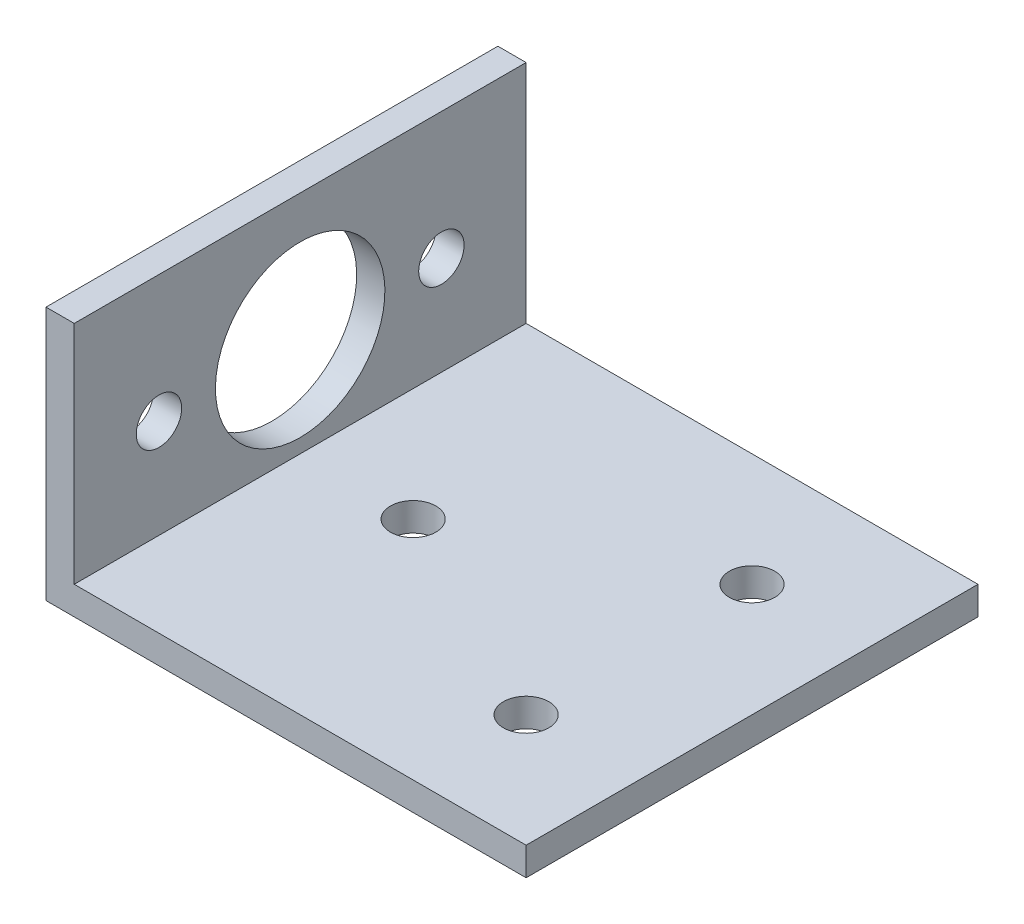
ISO-10303-21;
HEADER;
FILE_DESCRIPTION(('STEP AP214'),'2;1');
FILE_NAME('part.step','',(''),(''),'','','');
FILE_SCHEMA(('AUTOMOTIVE_DESIGN { 1 0 10303 214 1 1 1 1 }'));
ENDSEC;
DATA;
#1=APPLICATION_CONTEXT('core data for automotive mechanical design processes');
#2=APPLICATION_PROTOCOL_DEFINITION('international standard','automotive_design',2000,#1);
#3=PRODUCT_CONTEXT('',#1,'mechanical');
#4=PRODUCT('Part','Part','',(#3));
#5=PRODUCT_RELATED_PRODUCT_CATEGORY('part','',(#4));
#6=PRODUCT_DEFINITION_FORMATION('','',#4);
#7=PRODUCT_DEFINITION_CONTEXT('part definition',#1,'design');
#8=PRODUCT_DEFINITION('design','',#6,#7);
#9=PRODUCT_DEFINITION_SHAPE('','',#8);
#10=(LENGTH_UNIT() NAMED_UNIT(*) SI_UNIT(.MILLI.,.METRE.));
#11=(NAMED_UNIT(*) PLANE_ANGLE_UNIT() SI_UNIT($,.RADIAN.));
#12=(NAMED_UNIT(*) SI_UNIT($,.STERADIAN.) SOLID_ANGLE_UNIT());
#13=UNCERTAINTY_MEASURE_WITH_UNIT(LENGTH_MEASURE(1.E-05),#10,'distance_accuracy_value','');
#14=(GEOMETRIC_REPRESENTATION_CONTEXT(3) GLOBAL_UNCERTAINTY_ASSIGNED_CONTEXT((#13)) GLOBAL_UNIT_ASSIGNED_CONTEXT((#10,
#11,#12)) REPRESENTATION_CONTEXT('',''));
#15=CARTESIAN_POINT('',(0.,0.,0.));
#16=DIRECTION('',(0.,0.,1.));
#17=DIRECTION('',(1.,0.,0.));
#18=AXIS2_PLACEMENT_3D('',#15,#16,#17);
#19=CARTESIAN_POINT('',(3.175,50.8,50.8));
#20=DIRECTION('',(-1.,0.,0.));
#21=DIRECTION('',(0.,-1.,0.));
#22=AXIS2_PLACEMENT_3D('',#19,#20,#21);
#23=PLANE('',#22);
#24=CARTESIAN_POINT('',(3.175,14.2875,41.275));
#25=DIRECTION('',(-1.,0.,0.));
#26=DIRECTION('',(0.,1.,0.));
#27=AXIS2_PLACEMENT_3D('',#24,#25,#26);
#28=CIRCLE('',#27,2.5527);
#29=CARTESIAN_POINT('',(3.175,16.8402,41.275));
#30=VERTEX_POINT('',#29);
#31=EDGE_CURVE('E180',#30,#30,#28,.T.);
#32=ORIENTED_EDGE('',*,*,#31,.T.);
#33=EDGE_LOOP('',(#32));
#34=FACE_BOUND('',#33,.T.);
#35=CARTESIAN_POINT('',(3.175,14.2875,9.525));
#36=DIRECTION('',(-1.,0.,0.));
#37=DIRECTION('',(0.,-1.,0.));
#38=AXIS2_PLACEMENT_3D('',#35,#36,#37);
#39=CIRCLE('',#38,2.5527);
#40=CARTESIAN_POINT('',(3.175,11.7348,9.525));
#41=VERTEX_POINT('',#40);
#42=EDGE_CURVE('E184',#41,#41,#39,.T.);
#43=ORIENTED_EDGE('',*,*,#42,.T.);
#44=EDGE_LOOP('',(#43));
#45=FACE_BOUND('',#44,.T.);
#46=CARTESIAN_POINT('',(3.175,14.2875,25.4));
#47=DIRECTION('',(-1.,0.,0.));
#48=DIRECTION('',(0.,-1.,0.));
#49=AXIS2_PLACEMENT_3D('',#46,#47,#48);
#50=CIRCLE('',#49,9.525);
#51=CARTESIAN_POINT('',(3.17500000000001,4.7625,25.4));
#52=VERTEX_POINT('',#51);
#53=EDGE_CURVE('E115',#52,#52,#50,.T.);
#54=ORIENTED_EDGE('',*,*,#53,.T.);
#55=EDGE_LOOP('',(#54));
#56=FACE_BOUND('',#55,.T.);
#57=DIRECTION('',(0.,1.,0.));
#58=VECTOR('',#57,1.);
#59=CARTESIAN_POINT('',(3.175,50.8,0.));
#60=LINE('',#59,#58);
#61=CARTESIAN_POINT('',(3.17500000000001,3.175,0.));
#62=VERTEX_POINT('',#61);
#63=CARTESIAN_POINT('',(3.175,28.575,0.));
#64=VERTEX_POINT('',#63);
#65=EDGE_CURVE('E111',#62,#64,#60,.T.);
#66=ORIENTED_EDGE('',*,*,#65,.T.);
#67=DIRECTION('',(0.,0.,1.));
#68=VECTOR('',#67,1.);
#69=CARTESIAN_POINT('',(3.175,28.575,50.8));
#70=LINE('',#69,#68);
#71=CARTESIAN_POINT('',(3.175,28.575,50.8));
#72=VERTEX_POINT('',#71);
#73=EDGE_CURVE('E49',#64,#72,#70,.T.);
#74=ORIENTED_EDGE('',*,*,#73,.T.);
#75=DIRECTION('',(0.,1.,0.));
#76=VECTOR('',#75,1.);
#77=CARTESIAN_POINT('',(3.175,50.8,50.8));
#78=LINE('',#77,#76);
#79=CARTESIAN_POINT('',(3.17500000000001,3.175,50.8));
#80=VERTEX_POINT('',#79);
#81=EDGE_CURVE('E121',#80,#72,#78,.T.);
#82=ORIENTED_EDGE('',*,*,#81,.F.);
#83=DIRECTION('',(0.,0.,-1.));
#84=VECTOR('',#83,1.);
#85=CARTESIAN_POINT('',(3.17500000000001,3.175,50.8));
#86=LINE('',#85,#84);
#87=EDGE_CURVE('E122',#80,#62,#86,.T.);
#88=ORIENTED_EDGE('',*,*,#87,.T.);
#89=EDGE_LOOP('',(#66,#74,#82,#88));
#90=FACE_BOUND('',#89,.T.);
#91=ADVANCED_FACE('F33',(#34,#45,#56,#90),#23,.F.);
#92=CARTESIAN_POINT('',(0.,50.8,50.8));
#93=DIRECTION('',(1.,0.,0.));
#94=DIRECTION('',(0.,1.,0.));
#95=AXIS2_PLACEMENT_3D('',#92,#93,#94);
#96=PLANE('',#95);
#97=CARTESIAN_POINT('',(0.,14.2875,41.275));
#98=DIRECTION('',(-1.,0.,0.));
#99=DIRECTION('',(0.,1.,0.));
#100=AXIS2_PLACEMENT_3D('',#97,#98,#99);
#101=CIRCLE('',#100,2.5527);
#102=CARTESIAN_POINT('',(0.,16.8402,41.275));
#103=VERTEX_POINT('',#102);
#104=EDGE_CURVE('E244',#103,#103,#101,.T.);
#105=ORIENTED_EDGE('',*,*,#104,.F.);
#106=EDGE_LOOP('',(#105));
#107=FACE_BOUND('',#106,.T.);
#108=CARTESIAN_POINT('',(0.,14.2875,9.525));
#109=DIRECTION('',(-1.,0.,0.));
#110=DIRECTION('',(0.,-1.,0.));
#111=AXIS2_PLACEMENT_3D('',#108,#109,#110);
#112=CIRCLE('',#111,2.5527);
#113=CARTESIAN_POINT('',(0.,11.7348,9.525));
#114=VERTEX_POINT('',#113);
#115=EDGE_CURVE('E246',#114,#114,#112,.T.);
#116=ORIENTED_EDGE('',*,*,#115,.F.);
#117=EDGE_LOOP('',(#116));
#118=FACE_BOUND('',#117,.T.);
#119=CARTESIAN_POINT('',(0.,14.2875,25.4));
#120=DIRECTION('',(-1.,0.,0.));
#121=DIRECTION('',(0.,-1.,0.));
#122=AXIS2_PLACEMENT_3D('',#119,#120,#121);
#123=CIRCLE('',#122,9.525);
#124=CARTESIAN_POINT('',(0.,4.7625,25.4));
#125=VERTEX_POINT('',#124);
#126=EDGE_CURVE('E150',#125,#125,#123,.T.);
#127=ORIENTED_EDGE('',*,*,#126,.F.);
#128=EDGE_LOOP('',(#127));
#129=FACE_BOUND('',#128,.T.);
#130=DIRECTION('',(0.,-1.,0.));
#131=VECTOR('',#130,1.);
#132=CARTESIAN_POINT('',(0.,50.8,50.8));
#133=LINE('',#132,#131);
#134=CARTESIAN_POINT('',(0.,28.575,50.8));
#135=VERTEX_POINT('',#134);
#136=CARTESIAN_POINT('',(0.,0.,50.8));
#137=VERTEX_POINT('',#136);
#138=EDGE_CURVE('E85',#135,#137,#133,.T.);
#139=ORIENTED_EDGE('',*,*,#138,.F.);
#140=DIRECTION('',(0.,0.,1.));
#141=VECTOR('',#140,1.);
#142=CARTESIAN_POINT('',(0.,28.575,50.8));
#143=LINE('',#142,#141);
#144=CARTESIAN_POINT('',(0.,28.575,0.));
#145=VERTEX_POINT('',#144);
#146=EDGE_CURVE('E95',#145,#135,#143,.T.);
#147=ORIENTED_EDGE('',*,*,#146,.F.);
#148=DIRECTION('',(0.,-1.,0.));
#149=VECTOR('',#148,1.);
#150=CARTESIAN_POINT('',(0.,50.8,0.));
#151=LINE('',#150,#149);
#152=CARTESIAN_POINT('',(0.,0.,0.));
#153=VERTEX_POINT('',#152);
#154=EDGE_CURVE('E102',#145,#153,#151,.T.);
#155=ORIENTED_EDGE('',*,*,#154,.T.);
#156=DIRECTION('',(0.,0.,-1.));
#157=VECTOR('',#156,1.);
#158=CARTESIAN_POINT('',(0.,0.,50.8));
#159=LINE('',#158,#157);
#160=EDGE_CURVE('E41',#137,#153,#159,.T.);
#161=ORIENTED_EDGE('',*,*,#160,.F.);
#162=EDGE_LOOP('',(#139,#147,#155,#161));
#163=FACE_BOUND('',#162,.T.);
#164=ADVANCED_FACE('F101',(#107,#118,#129,#163),#96,.F.);
#165=CARTESIAN_POINT('',(3.17500000000001,0.,50.8));
#166=DIRECTION('',(0.,1.,0.));
#167=DIRECTION('',(-1.,0.,0.));
#168=AXIS2_PLACEMENT_3D('',#165,#166,#167);
#169=PLANE('',#168);
#170=CARTESIAN_POINT('',(41.275,0.,12.7));
#171=DIRECTION('',(0.,-1.,0.));
#172=DIRECTION('',(1.,0.,0.));
#173=AXIS2_PLACEMENT_3D('',#170,#171,#172);
#174=CIRCLE('',#173,2.5527);
#175=CARTESIAN_POINT('',(43.8277,0.,12.7));
#176=VERTEX_POINT('',#175);
#177=EDGE_CURVE('E144',#176,#176,#174,.T.);
#178=ORIENTED_EDGE('',*,*,#177,.F.);
#179=EDGE_LOOP('',(#178));
#180=FACE_BOUND('',#179,.T.);
#181=CARTESIAN_POINT('',(41.275,0.,38.1));
#182=DIRECTION('',(0.,-1.,0.));
#183=DIRECTION('',(1.,0.,0.));
#184=AXIS2_PLACEMENT_3D('',#181,#182,#183);
#185=CIRCLE('',#184,2.5527);
#186=CARTESIAN_POINT('',(43.8277,0.,38.1));
#187=VERTEX_POINT('',#186);
#188=EDGE_CURVE('E134',#187,#187,#185,.T.);
#189=ORIENTED_EDGE('',*,*,#188,.F.);
#190=EDGE_LOOP('',(#189));
#191=FACE_BOUND('',#190,.T.);
#192=CARTESIAN_POINT('',(15.875,0.,25.4));
#193=DIRECTION('',(0.,-1.,0.));
#194=DIRECTION('',(1.,0.,0.));
#195=AXIS2_PLACEMENT_3D('',#192,#193,#194);
#196=CIRCLE('',#195,2.5527);
#197=CARTESIAN_POINT('',(18.4277,0.,25.4));
#198=VERTEX_POINT('',#197);
#199=EDGE_CURVE('E131',#198,#198,#196,.T.);
#200=ORIENTED_EDGE('',*,*,#199,.F.);
#201=EDGE_LOOP('',(#200));
#202=FACE_BOUND('',#201,.T.);
#203=DIRECTION('',(1.,0.,0.));
#204=VECTOR('',#203,1.);
#205=CARTESIAN_POINT('',(3.17500000000001,0.,0.));
#206=LINE('',#205,#204);
#207=CARTESIAN_POINT('',(53.975,0.,0.));
#208=VERTEX_POINT('',#207);
#209=EDGE_CURVE('E109',#153,#208,#206,.T.);
#210=ORIENTED_EDGE('',*,*,#209,.T.);
#211=DIRECTION('',(0.,0.,-1.));
#212=VECTOR('',#211,1.);
#213=CARTESIAN_POINT('',(53.975,0.,50.8));
#214=LINE('',#213,#212);
#215=CARTESIAN_POINT('',(53.975,0.,50.8));
#216=VERTEX_POINT('',#215);
#217=EDGE_CURVE('E126',#216,#208,#214,.T.);
#218=ORIENTED_EDGE('',*,*,#217,.F.);
#219=DIRECTION('',(1.,0.,0.));
#220=VECTOR('',#219,1.);
#221=CARTESIAN_POINT('',(3.17500000000001,0.,50.8));
#222=LINE('',#221,#220);
#223=EDGE_CURVE('E157',#137,#216,#222,.T.);
#224=ORIENTED_EDGE('',*,*,#223,.F.);
#225=ORIENTED_EDGE('',*,*,#160,.T.);
#226=EDGE_LOOP('',(#210,#218,#224,#225));
#227=FACE_BOUND('',#226,.T.);
#228=ADVANCED_FACE('F175',(#180,#191,#202,#227),#169,.F.);
#229=CARTESIAN_POINT('',(53.975,0.,50.8));
#230=DIRECTION('',(-1.,0.,0.));
#231=DIRECTION('',(0.,0.,1.));
#232=AXIS2_PLACEMENT_3D('',#229,#230,#231);
#233=PLANE('',#232);
#234=DIRECTION('',(0.,1.,0.));
#235=VECTOR('',#234,1.);
#236=CARTESIAN_POINT('',(53.975,0.,0.));
#237=LINE('',#236,#235);
#238=CARTESIAN_POINT('',(53.975,3.175,0.));
#239=VERTEX_POINT('',#238);
#240=EDGE_CURVE('E113',#208,#239,#237,.T.);
#241=ORIENTED_EDGE('',*,*,#240,.T.);
#242=DIRECTION('',(0.,0.,-1.));
#243=VECTOR('',#242,1.);
#244=CARTESIAN_POINT('',(53.975,3.175,50.8));
#245=LINE('',#244,#243);
#246=CARTESIAN_POINT('',(53.975,3.175,50.8));
#247=VERTEX_POINT('',#246);
#248=EDGE_CURVE('E124',#247,#239,#245,.T.);
#249=ORIENTED_EDGE('',*,*,#248,.F.);
#250=DIRECTION('',(0.,1.,0.));
#251=VECTOR('',#250,1.);
#252=CARTESIAN_POINT('',(53.975,0.,50.8));
#253=LINE('',#252,#251);
#254=EDGE_CURVE('E159',#216,#247,#253,.T.);
#255=ORIENTED_EDGE('',*,*,#254,.F.);
#256=ORIENTED_EDGE('',*,*,#217,.T.);
#257=EDGE_LOOP('',(#241,#249,#255,#256));
#258=FACE_BOUND('',#257,.T.);
#259=ADVANCED_FACE('F166',(#258),#233,.F.);
#260=CARTESIAN_POINT('',(3.17500000000001,3.175,50.8));
#261=DIRECTION('',(0.,-1.,0.));
#262=DIRECTION('',(0.,0.,-1.));
#263=AXIS2_PLACEMENT_3D('',#260,#261,#262);
#264=PLANE('',#263);
#265=CARTESIAN_POINT('',(41.275,3.175,12.7));
#266=DIRECTION('',(0.,-1.,0.));
#267=DIRECTION('',(0.,0.,-1.));
#268=AXIS2_PLACEMENT_3D('',#265,#266,#267);
#269=CIRCLE('',#268,2.5527);
#270=CARTESIAN_POINT('',(41.275,3.175,10.1473));
#271=VERTEX_POINT('',#270);
#272=EDGE_CURVE('E36',#271,#271,#269,.T.);
#273=ORIENTED_EDGE('',*,*,#272,.T.);
#274=EDGE_LOOP('',(#273));
#275=FACE_BOUND('',#274,.T.);
#276=CARTESIAN_POINT('',(41.275,3.175,38.1));
#277=DIRECTION('',(0.,-1.,0.));
#278=DIRECTION('',(0.,0.,-1.));
#279=AXIS2_PLACEMENT_3D('',#276,#277,#278);
#280=CIRCLE('',#279,2.5527);
#281=CARTESIAN_POINT('',(41.275,3.175,35.5473));
#282=VERTEX_POINT('',#281);
#283=EDGE_CURVE('E132',#282,#282,#280,.T.);
#284=ORIENTED_EDGE('',*,*,#283,.T.);
#285=EDGE_LOOP('',(#284));
#286=FACE_BOUND('',#285,.T.);
#287=CARTESIAN_POINT('',(15.875,3.175,25.4));
#288=DIRECTION('',(0.,-1.,0.));
#289=DIRECTION('',(0.,0.,-1.));
#290=AXIS2_PLACEMENT_3D('',#287,#288,#289);
#291=CIRCLE('',#290,2.5527);
#292=CARTESIAN_POINT('',(15.875,3.175,22.8473));
#293=VERTEX_POINT('',#292);
#294=EDGE_CURVE('E105',#293,#293,#291,.T.);
#295=ORIENTED_EDGE('',*,*,#294,.T.);
#296=EDGE_LOOP('',(#295));
#297=FACE_BOUND('',#296,.T.);
#298=DIRECTION('',(-1.,0.,0.));
#299=VECTOR('',#298,1.);
#300=CARTESIAN_POINT('',(3.17500000000001,3.175,0.));
#301=LINE('',#300,#299);
#302=EDGE_CURVE('E78',#239,#62,#301,.T.);
#303=ORIENTED_EDGE('',*,*,#302,.T.);
#304=ORIENTED_EDGE('',*,*,#87,.F.);
#305=DIRECTION('',(-1.,0.,0.));
#306=VECTOR('',#305,1.);
#307=CARTESIAN_POINT('',(3.17500000000001,3.175,50.8));
#308=LINE('',#307,#306);
#309=EDGE_CURVE('E57',#247,#80,#308,.T.);
#310=ORIENTED_EDGE('',*,*,#309,.F.);
#311=ORIENTED_EDGE('',*,*,#248,.T.);
#312=EDGE_LOOP('',(#303,#304,#310,#311));
#313=FACE_BOUND('',#312,.T.);
#314=ADVANCED_FACE('F167',(#275,#286,#297,#313),#264,.F.);
#315=CARTESIAN_POINT('',(0.,0.,50.8));
#316=DIRECTION('',(0.,0.,1.));
#317=DIRECTION('',(1.,0.,0.));
#318=AXIS2_PLACEMENT_3D('',#315,#316,#317);
#319=PLANE('',#318);
#320=DIRECTION('',(-1.,0.,0.));
#321=VECTOR('',#320,1.);
#322=CARTESIAN_POINT('',(50.8,28.575,50.8));
#323=LINE('',#322,#321);
#324=EDGE_CURVE('E104',#72,#135,#323,.T.);
#325=ORIENTED_EDGE('',*,*,#324,.T.);
#326=ORIENTED_EDGE('',*,*,#138,.T.);
#327=ORIENTED_EDGE('',*,*,#223,.T.);
#328=ORIENTED_EDGE('',*,*,#254,.T.);
#329=ORIENTED_EDGE('',*,*,#309,.T.);
#330=ORIENTED_EDGE('',*,*,#81,.T.);
#331=EDGE_LOOP('',(#325,#326,#327,#328,#329,#330));
#332=FACE_BOUND('',#331,.T.);
#333=ADVANCED_FACE('F162',(#332),#319,.T.);
#334=CARTESIAN_POINT('',(0.,0.,0.));
#335=DIRECTION('',(0.,0.,1.));
#336=DIRECTION('',(1.,0.,0.));
#337=AXIS2_PLACEMENT_3D('',#334,#335,#336);
#338=PLANE('',#337);
#339=ORIENTED_EDGE('',*,*,#154,.F.);
#340=DIRECTION('',(1.,0.,0.));
#341=VECTOR('',#340,1.);
#342=CARTESIAN_POINT('',(0.,28.575,0.));
#343=LINE('',#342,#341);
#344=EDGE_CURVE('E11',#145,#64,#343,.T.);
#345=ORIENTED_EDGE('',*,*,#344,.T.);
#346=ORIENTED_EDGE('',*,*,#65,.F.);
#347=ORIENTED_EDGE('',*,*,#302,.F.);
#348=ORIENTED_EDGE('',*,*,#240,.F.);
#349=ORIENTED_EDGE('',*,*,#209,.F.);
#350=EDGE_LOOP('',(#339,#345,#346,#347,#348,#349));
#351=FACE_BOUND('',#350,.T.);
#352=ADVANCED_FACE('F107',(#351),#338,.F.);
#353=CARTESIAN_POINT('',(50.8,14.2875,25.4));
#354=DIRECTION('',(-1.,0.,0.));
#355=DIRECTION('',(0.,-1.,0.));
#356=AXIS2_PLACEMENT_3D('',#353,#354,#355);
#357=CYLINDRICAL_SURFACE('',#356,9.525);
#358=ORIENTED_EDGE('',*,*,#126,.T.);
#359=EDGE_LOOP('',(#358));
#360=FACE_BOUND('',#359,.T.);
#361=ORIENTED_EDGE('',*,*,#53,.F.);
#362=EDGE_LOOP('',(#361));
#363=FACE_BOUND('',#362,.T.);
#364=ADVANCED_FACE('F187',(#360,#363),#357,.F.);
#365=CARTESIAN_POINT('',(50.8,28.575,50.8));
#366=DIRECTION('',(0.,-1.,0.));
#367=DIRECTION('',(0.,0.,-1.));
#368=AXIS2_PLACEMENT_3D('',#365,#366,#367);
#369=PLANE('',#368);
#370=ORIENTED_EDGE('',*,*,#344,.F.);
#371=ORIENTED_EDGE('',*,*,#146,.T.);
#372=ORIENTED_EDGE('',*,*,#324,.F.);
#373=ORIENTED_EDGE('',*,*,#73,.F.);
#374=EDGE_LOOP('',(#370,#371,#372,#373));
#375=FACE_BOUND('',#374,.T.);
#376=ADVANCED_FACE('F94',(#375),#369,.F.);
#377=CARTESIAN_POINT('',(15.875,50.8,25.4));
#378=DIRECTION('',(0.,-1.,0.));
#379=DIRECTION('',(1.,0.,0.));
#380=AXIS2_PLACEMENT_3D('',#377,#378,#379);
#381=CYLINDRICAL_SURFACE('',#380,2.5527);
#382=ORIENTED_EDGE('',*,*,#199,.T.);
#383=EDGE_LOOP('',(#382));
#384=FACE_BOUND('',#383,.T.);
#385=ORIENTED_EDGE('',*,*,#294,.F.);
#386=EDGE_LOOP('',(#385));
#387=FACE_BOUND('',#386,.T.);
#388=ADVANCED_FACE('F195',(#384,#387),#381,.F.);
#389=CARTESIAN_POINT('',(41.275,50.8,38.1));
#390=DIRECTION('',(0.,-1.,0.));
#391=DIRECTION('',(1.,0.,0.));
#392=AXIS2_PLACEMENT_3D('',#389,#390,#391);
#393=CYLINDRICAL_SURFACE('',#392,2.5527);
#394=ORIENTED_EDGE('',*,*,#188,.T.);
#395=EDGE_LOOP('',(#394));
#396=FACE_BOUND('',#395,.T.);
#397=ORIENTED_EDGE('',*,*,#283,.F.);
#398=EDGE_LOOP('',(#397));
#399=FACE_BOUND('',#398,.T.);
#400=ADVANCED_FACE('F220',(#396,#399),#393,.F.);
#401=CARTESIAN_POINT('',(41.275,50.8,12.7));
#402=DIRECTION('',(0.,-1.,0.));
#403=DIRECTION('',(1.,0.,0.));
#404=AXIS2_PLACEMENT_3D('',#401,#402,#403);
#405=CYLINDRICAL_SURFACE('',#404,2.5527);
#406=ORIENTED_EDGE('',*,*,#177,.T.);
#407=EDGE_LOOP('',(#406));
#408=FACE_BOUND('',#407,.T.);
#409=ORIENTED_EDGE('',*,*,#272,.F.);
#410=EDGE_LOOP('',(#409));
#411=FACE_BOUND('',#410,.T.);
#412=ADVANCED_FACE('F226',(#408,#411),#405,.F.);
#413=CARTESIAN_POINT('',(3.175,14.2875,9.525));
#414=DIRECTION('',(-1.,0.,0.));
#415=DIRECTION('',(0.,-1.,0.));
#416=AXIS2_PLACEMENT_3D('',#413,#414,#415);
#417=CYLINDRICAL_SURFACE('',#416,2.5527);
#418=ORIENTED_EDGE('',*,*,#42,.F.);
#419=EDGE_LOOP('',(#418));
#420=FACE_BOUND('',#419,.T.);
#421=ORIENTED_EDGE('',*,*,#115,.T.);
#422=EDGE_LOOP('',(#421));
#423=FACE_BOUND('',#422,.T.);
#424=ADVANCED_FACE('F231',(#420,#423),#417,.F.);
#425=CARTESIAN_POINT('',(3.175,14.2875,41.275));
#426=DIRECTION('',(-1.,0.,0.));
#427=DIRECTION('',(0.,-1.,0.));
#428=AXIS2_PLACEMENT_3D('',#425,#426,#427);
#429=CYLINDRICAL_SURFACE('',#428,2.5527);
#430=ORIENTED_EDGE('',*,*,#31,.F.);
#431=EDGE_LOOP('',(#430));
#432=FACE_BOUND('',#431,.T.);
#433=ORIENTED_EDGE('',*,*,#104,.T.);
#434=EDGE_LOOP('',(#433));
#435=FACE_BOUND('',#434,.T.);
#436=ADVANCED_FACE('F235',(#432,#435),#429,.F.);
#437=CLOSED_SHELL('',(#91,#164,#228,#259,#314,#333,#352,#364,#376,#388,#400,#412,#424,#436));
#438=MANIFOLD_SOLID_BREP('B2',#437);
#439=ADVANCED_BREP_SHAPE_REPRESENTATION('',(#18,#438),#14);
#440=SHAPE_DEFINITION_REPRESENTATION(#9,#439);
ENDSEC;
END-ISO-10303-21;
